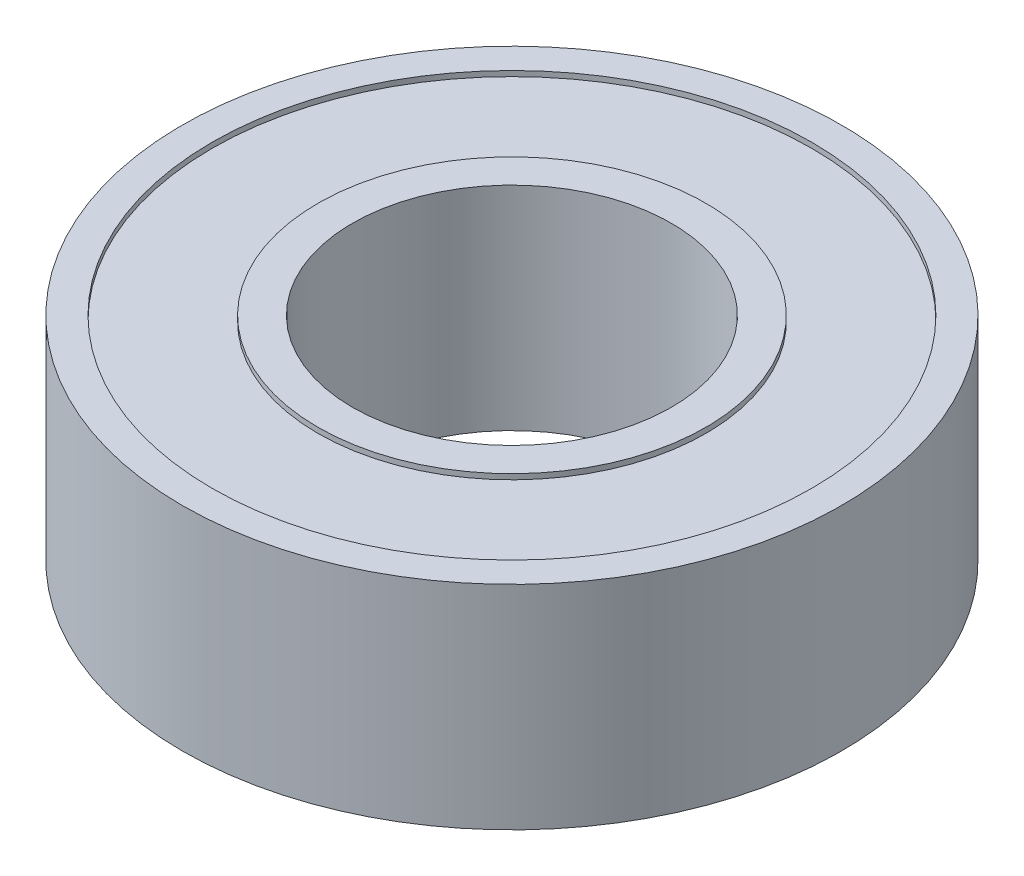
ISO-10303-21;
HEADER;
FILE_DESCRIPTION(('STEP AP214'),'2;1');
FILE_NAME('part.step','',(''),(''),'','','');
FILE_SCHEMA(('AUTOMOTIVE_DESIGN { 1 0 10303 214 1 1 1 1 }'));
ENDSEC;
DATA;
#1=APPLICATION_CONTEXT('core data for automotive mechanical design processes');
#2=APPLICATION_PROTOCOL_DEFINITION('international standard','automotive_design',2000,#1);
#3=PRODUCT_CONTEXT('',#1,'mechanical');
#4=PRODUCT('Part','Part','',(#3));
#5=PRODUCT_RELATED_PRODUCT_CATEGORY('part','',(#4));
#6=PRODUCT_DEFINITION_FORMATION('','',#4);
#7=PRODUCT_DEFINITION_CONTEXT('part definition',#1,'design');
#8=PRODUCT_DEFINITION('design','',#6,#7);
#9=PRODUCT_DEFINITION_SHAPE('','',#8);
#10=(LENGTH_UNIT() NAMED_UNIT(*) SI_UNIT(.MILLI.,.METRE.));
#11=(NAMED_UNIT(*) PLANE_ANGLE_UNIT() SI_UNIT($,.RADIAN.));
#12=(NAMED_UNIT(*) SI_UNIT($,.STERADIAN.) SOLID_ANGLE_UNIT());
#13=UNCERTAINTY_MEASURE_WITH_UNIT(LENGTH_MEASURE(1.E-05),#10,'distance_accuracy_value','');
#14=(GEOMETRIC_REPRESENTATION_CONTEXT(3) GLOBAL_UNCERTAINTY_ASSIGNED_CONTEXT((#13)) GLOBAL_UNIT_ASSIGNED_CONTEXT((#10,
#11,#12)) REPRESENTATION_CONTEXT('',''));
#15=CARTESIAN_POINT('',(0.,0.,0.));
#16=DIRECTION('',(0.,0.,1.));
#17=DIRECTION('',(1.,0.,0.));
#18=AXIS2_PLACEMENT_3D('',#15,#16,#17);
#19=CARTESIAN_POINT('',(0.,0.,0.));
#20=DIRECTION('',(0.,1.,0.));
#21=DIRECTION('',(0.,0.,1.));
#22=AXIS2_PLACEMENT_3D('',#19,#20,#21);
#23=PLANE('',#22);
#24=CARTESIAN_POINT('',(0.,0.,0.));
#25=DIRECTION('',(0.,1.,0.));
#26=DIRECTION('',(0.,0.,1.));
#27=AXIS2_PLACEMENT_3D('',#24,#25,#26);
#28=CIRCLE('',#27,15.);
#29=CARTESIAN_POINT('',(0.,0.,15.));
#30=VERTEX_POINT('',#29);
#31=EDGE_CURVE('E45',#30,#30,#28,.T.);
#32=ORIENTED_EDGE('',*,*,#31,.T.);
#33=EDGE_LOOP('',(#32));
#34=FACE_BOUND('',#33,.T.);
#35=CARTESIAN_POINT('',(0.,0.,0.));
#36=DIRECTION('',(0.,-1.,0.));
#37=DIRECTION('',(0.,0.,-1.));
#38=AXIS2_PLACEMENT_3D('',#35,#36,#37);
#39=CIRCLE('',#38,18.25);
#40=CARTESIAN_POINT('',(0.,0.,-18.25));
#41=VERTEX_POINT('',#40);
#42=EDGE_CURVE('E69',#41,#41,#39,.T.);
#43=ORIENTED_EDGE('',*,*,#42,.T.);
#44=EDGE_LOOP('',(#43));
#45=FACE_BOUND('',#44,.T.);
#46=ADVANCED_FACE('F32',(#34,#45),#23,.F.);
#47=CARTESIAN_POINT('',(0.,20.,0.));
#48=DIRECTION('',(0.,1.,0.));
#49=DIRECTION('',(0.,0.,1.));
#50=AXIS2_PLACEMENT_3D('',#47,#48,#49);
#51=PLANE('',#50);
#52=CARTESIAN_POINT('',(0.,20.,0.));
#53=DIRECTION('',(0.,1.,0.));
#54=DIRECTION('',(0.,0.,1.));
#55=AXIS2_PLACEMENT_3D('',#52,#53,#54);
#56=CIRCLE('',#55,15.);
#57=CARTESIAN_POINT('',(0.,20.,15.));
#58=VERTEX_POINT('',#57);
#59=EDGE_CURVE('E43',#58,#58,#56,.T.);
#60=ORIENTED_EDGE('',*,*,#59,.F.);
#61=EDGE_LOOP('',(#60));
#62=FACE_BOUND('',#61,.T.);
#63=CARTESIAN_POINT('',(0.,20.,0.));
#64=DIRECTION('',(0.,1.,0.));
#65=DIRECTION('',(0.,0.,1.));
#66=AXIS2_PLACEMENT_3D('',#63,#64,#65);
#67=CIRCLE('',#66,18.25);
#68=CARTESIAN_POINT('',(0.,20.,18.25));
#69=VERTEX_POINT('',#68);
#70=EDGE_CURVE('E57',#69,#69,#67,.T.);
#71=ORIENTED_EDGE('',*,*,#70,.T.);
#72=EDGE_LOOP('',(#71));
#73=FACE_BOUND('',#72,.T.);
#74=ADVANCED_FACE('F107',(#62,#73),#51,.T.);
#75=CARTESIAN_POINT('',(0.,20.,0.));
#76=DIRECTION('',(0.,1.,0.));
#77=DIRECTION('',(0.,0.,1.));
#78=AXIS2_PLACEMENT_3D('',#75,#76,#77);
#79=CIRCLE('',#78,28.2);
#80=CARTESIAN_POINT('',(0.,20.,28.2));
#81=VERTEX_POINT('',#80);
#82=EDGE_CURVE('E51',#81,#81,#79,.T.);
#83=ORIENTED_EDGE('',*,*,#82,.F.);
#84=EDGE_LOOP('',(#83));
#85=FACE_BOUND('',#84,.T.);
#86=CARTESIAN_POINT('',(0.,20.,0.));
#87=DIRECTION('',(0.,1.,0.));
#88=DIRECTION('',(0.,0.,1.));
#89=AXIS2_PLACEMENT_3D('',#86,#87,#88);
#90=CIRCLE('',#89,31.);
#91=CARTESIAN_POINT('',(0.,20.,31.));
#92=VERTEX_POINT('',#91);
#93=EDGE_CURVE('E10',#92,#92,#90,.T.);
#94=ORIENTED_EDGE('',*,*,#93,.T.);
#95=EDGE_LOOP('',(#94));
#96=FACE_BOUND('',#95,.T.);
#97=ADVANCED_FACE('F94',(#85,#96),#51,.T.);
#98=CARTESIAN_POINT('',(0.,0.,0.));
#99=DIRECTION('',(0.,-1.,0.));
#100=DIRECTION('',(0.,0.,-1.));
#101=AXIS2_PLACEMENT_3D('',#98,#99,#100);
#102=CIRCLE('',#101,28.2);
#103=CARTESIAN_POINT('',(0.,0.,-28.2));
#104=VERTEX_POINT('',#103);
#105=EDGE_CURVE('E63',#104,#104,#102,.T.);
#106=ORIENTED_EDGE('',*,*,#105,.F.);
#107=EDGE_LOOP('',(#106));
#108=FACE_BOUND('',#107,.T.);
#109=CARTESIAN_POINT('',(0.,0.,0.));
#110=DIRECTION('',(0.,1.,0.));
#111=DIRECTION('',(0.,0.,1.));
#112=AXIS2_PLACEMENT_3D('',#109,#110,#111);
#113=CIRCLE('',#112,31.);
#114=CARTESIAN_POINT('',(0.,0.,31.));
#115=VERTEX_POINT('',#114);
#116=EDGE_CURVE('E36',#115,#115,#113,.T.);
#117=ORIENTED_EDGE('',*,*,#116,.F.);
#118=EDGE_LOOP('',(#117));
#119=FACE_BOUND('',#118,.T.);
#120=ADVANCED_FACE('F91',(#108,#119),#23,.F.);
#121=CARTESIAN_POINT('',(0.,20.,0.));
#122=DIRECTION('',(0.,-1.,0.));
#123=DIRECTION('',(0.,0.,-1.));
#124=AXIS2_PLACEMENT_3D('',#121,#122,#123);
#125=CYLINDRICAL_SURFACE('',#124,31.);
#126=ORIENTED_EDGE('',*,*,#93,.F.);
#127=EDGE_LOOP('',(#126));
#128=FACE_BOUND('',#127,.T.);
#129=ORIENTED_EDGE('',*,*,#116,.T.);
#130=EDGE_LOOP('',(#129));
#131=FACE_BOUND('',#130,.T.);
#132=ADVANCED_FACE('F34',(#128,#131),#125,.T.);
#133=CARTESIAN_POINT('',(0.,20.,0.));
#134=DIRECTION('',(0.,-1.,0.));
#135=DIRECTION('',(0.,0.,-1.));
#136=AXIS2_PLACEMENT_3D('',#133,#134,#135);
#137=CYLINDRICAL_SURFACE('',#136,15.);
#138=ORIENTED_EDGE('',*,*,#59,.T.);
#139=EDGE_LOOP('',(#138));
#140=FACE_BOUND('',#139,.T.);
#141=ORIENTED_EDGE('',*,*,#31,.F.);
#142=EDGE_LOOP('',(#141));
#143=FACE_BOUND('',#142,.T.);
#144=ADVANCED_FACE('F98',(#140,#143),#137,.F.);
#145=CARTESIAN_POINT('',(0.,19.5,0.));
#146=DIRECTION('',(0.,1.,0.));
#147=DIRECTION('',(0.,0.,1.));
#148=AXIS2_PLACEMENT_3D('',#145,#146,#147);
#149=CYLINDRICAL_SURFACE('',#148,28.2);
#150=CARTESIAN_POINT('',(0.,19.5,0.));
#151=DIRECTION('',(0.,1.,0.));
#152=DIRECTION('',(0.,0.,1.));
#153=AXIS2_PLACEMENT_3D('',#150,#151,#152);
#154=CIRCLE('',#153,28.2);
#155=CARTESIAN_POINT('',(0.,19.5,28.2));
#156=VERTEX_POINT('',#155);
#157=EDGE_CURVE('E48',#156,#156,#154,.T.);
#158=ORIENTED_EDGE('',*,*,#157,.F.);
#159=EDGE_LOOP('',(#158));
#160=FACE_BOUND('',#159,.T.);
#161=ORIENTED_EDGE('',*,*,#82,.T.);
#162=EDGE_LOOP('',(#161));
#163=FACE_BOUND('',#162,.T.);
#164=ADVANCED_FACE('F103',(#160,#163),#149,.F.);
#165=CARTESIAN_POINT('',(0.,19.5,0.));
#166=DIRECTION('',(0.,1.,0.));
#167=DIRECTION('',(0.,0.,1.));
#168=AXIS2_PLACEMENT_3D('',#165,#166,#167);
#169=PLANE('',#168);
#170=CARTESIAN_POINT('',(0.,19.5,0.));
#171=DIRECTION('',(0.,1.,0.));
#172=DIRECTION('',(0.,0.,1.));
#173=AXIS2_PLACEMENT_3D('',#170,#171,#172);
#174=CIRCLE('',#173,18.25);
#175=CARTESIAN_POINT('',(0.,19.5,18.25));
#176=VERTEX_POINT('',#175);
#177=EDGE_CURVE('E54',#176,#176,#174,.T.);
#178=ORIENTED_EDGE('',*,*,#177,.F.);
#179=EDGE_LOOP('',(#178));
#180=FACE_BOUND('',#179,.T.);
#181=ORIENTED_EDGE('',*,*,#157,.T.);
#182=EDGE_LOOP('',(#181));
#183=FACE_BOUND('',#182,.T.);
#184=ADVANCED_FACE('F120',(#180,#183),#169,.T.);
#185=CARTESIAN_POINT('',(0.,19.5,0.));
#186=DIRECTION('',(0.,1.,0.));
#187=DIRECTION('',(0.,0.,1.));
#188=AXIS2_PLACEMENT_3D('',#185,#186,#187);
#189=CYLINDRICAL_SURFACE('',#188,18.25);
#190=ORIENTED_EDGE('',*,*,#177,.T.);
#191=EDGE_LOOP('',(#190));
#192=FACE_BOUND('',#191,.T.);
#193=ORIENTED_EDGE('',*,*,#70,.F.);
#194=EDGE_LOOP('',(#193));
#195=FACE_BOUND('',#194,.T.);
#196=ADVANCED_FACE('F87',(#192,#195),#189,.T.);
#197=CARTESIAN_POINT('',(0.,0.5,0.));
#198=DIRECTION('',(0.,-1.,0.));
#199=DIRECTION('',(0.,0.,-1.));
#200=AXIS2_PLACEMENT_3D('',#197,#198,#199);
#201=CYLINDRICAL_SURFACE('',#200,28.2);
#202=CARTESIAN_POINT('',(0.,0.5,0.));
#203=DIRECTION('',(0.,-1.,0.));
#204=DIRECTION('',(0.,0.,-1.));
#205=AXIS2_PLACEMENT_3D('',#202,#203,#204);
#206=CIRCLE('',#205,28.2);
#207=CARTESIAN_POINT('',(0.,0.5,-28.2));
#208=VERTEX_POINT('',#207);
#209=EDGE_CURVE('E60',#208,#208,#206,.T.);
#210=ORIENTED_EDGE('',*,*,#209,.F.);
#211=EDGE_LOOP('',(#210));
#212=FACE_BOUND('',#211,.T.);
#213=ORIENTED_EDGE('',*,*,#105,.T.);
#214=EDGE_LOOP('',(#213));
#215=FACE_BOUND('',#214,.T.);
#216=ADVANCED_FACE('F81',(#212,#215),#201,.F.);
#217=CARTESIAN_POINT('',(0.,0.5,0.));
#218=DIRECTION('',(0.,-1.,0.));
#219=DIRECTION('',(0.,0.,-1.));
#220=AXIS2_PLACEMENT_3D('',#217,#218,#219);
#221=PLANE('',#220);
#222=CARTESIAN_POINT('',(0.,0.5,0.));
#223=DIRECTION('',(0.,-1.,0.));
#224=DIRECTION('',(0.,0.,-1.));
#225=AXIS2_PLACEMENT_3D('',#222,#223,#224);
#226=CIRCLE('',#225,18.25);
#227=CARTESIAN_POINT('',(0.,0.5,-18.25));
#228=VERTEX_POINT('',#227);
#229=EDGE_CURVE('E66',#228,#228,#226,.T.);
#230=ORIENTED_EDGE('',*,*,#229,.F.);
#231=EDGE_LOOP('',(#230));
#232=FACE_BOUND('',#231,.T.);
#233=ORIENTED_EDGE('',*,*,#209,.T.);
#234=EDGE_LOOP('',(#233));
#235=FACE_BOUND('',#234,.T.);
#236=ADVANCED_FACE('F78',(#232,#235),#221,.T.);
#237=CARTESIAN_POINT('',(0.,0.5,0.));
#238=DIRECTION('',(0.,-1.,0.));
#239=DIRECTION('',(0.,0.,-1.));
#240=AXIS2_PLACEMENT_3D('',#237,#238,#239);
#241=CYLINDRICAL_SURFACE('',#240,18.25);
#242=ORIENTED_EDGE('',*,*,#229,.T.);
#243=EDGE_LOOP('',(#242));
#244=FACE_BOUND('',#243,.T.);
#245=ORIENTED_EDGE('',*,*,#42,.F.);
#246=EDGE_LOOP('',(#245));
#247=FACE_BOUND('',#246,.T.);
#248=ADVANCED_FACE('F75',(#244,#247),#241,.T.);
#249=CLOSED_SHELL('',(#46,#74,#97,#120,#132,#144,#164,#184,#196,#216,#236,#248));
#250=MANIFOLD_SOLID_BREP('B2',#249);
#251=ADVANCED_BREP_SHAPE_REPRESENTATION('',(#18,#250),#14);
#252=SHAPE_DEFINITION_REPRESENTATION(#9,#251);
ENDSEC;
END-ISO-10303-21;
